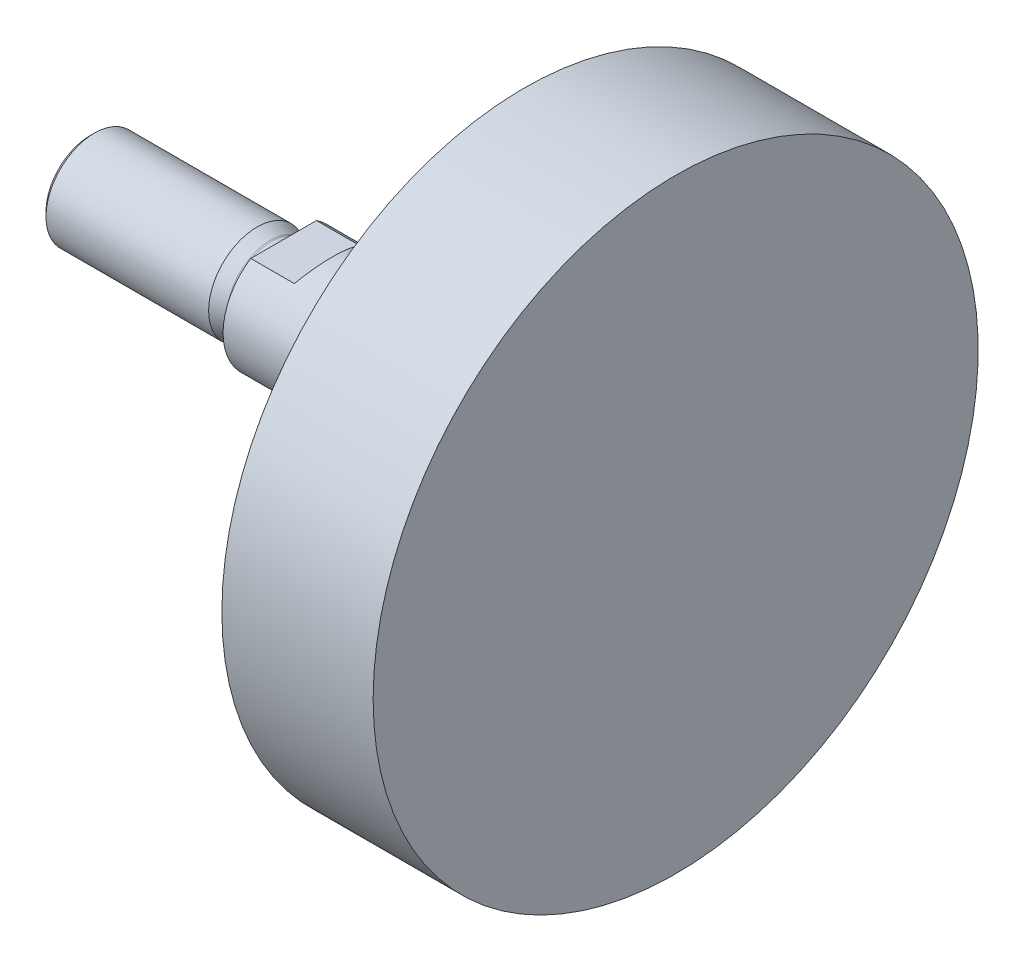
ISO-10303-21;
HEADER;
FILE_DESCRIPTION(('STEP AP214'),'2;1');
FILE_NAME('part.step','',(''),(''),'','','');
FILE_SCHEMA(('AUTOMOTIVE_DESIGN { 1 0 10303 214 1 1 1 1 }'));
ENDSEC;
DATA;
#1=APPLICATION_CONTEXT('core data for automotive mechanical design processes');
#2=APPLICATION_PROTOCOL_DEFINITION('international standard','automotive_design',2000,#1);
#3=PRODUCT_CONTEXT('',#1,'mechanical');
#4=PRODUCT('Part','Part','',(#3));
#5=PRODUCT_RELATED_PRODUCT_CATEGORY('part','',(#4));
#6=PRODUCT_DEFINITION_FORMATION('','',#4);
#7=PRODUCT_DEFINITION_CONTEXT('part definition',#1,'design');
#8=PRODUCT_DEFINITION('design','',#6,#7);
#9=PRODUCT_DEFINITION_SHAPE('','',#8);
#10=(LENGTH_UNIT() NAMED_UNIT(*) SI_UNIT(.MILLI.,.METRE.));
#11=(NAMED_UNIT(*) PLANE_ANGLE_UNIT() SI_UNIT($,.RADIAN.));
#12=(NAMED_UNIT(*) SI_UNIT($,.STERADIAN.) SOLID_ANGLE_UNIT());
#13=UNCERTAINTY_MEASURE_WITH_UNIT(LENGTH_MEASURE(1.E-05),#10,'distance_accuracy_value','');
#14=(GEOMETRIC_REPRESENTATION_CONTEXT(3) GLOBAL_UNCERTAINTY_ASSIGNED_CONTEXT((#13)) GLOBAL_UNIT_ASSIGNED_CONTEXT((#10,
#11,#12)) REPRESENTATION_CONTEXT('',''));
#15=CARTESIAN_POINT('',(0.,0.,0.));
#16=DIRECTION('',(0.,0.,1.));
#17=DIRECTION('',(1.,0.,0.));
#18=AXIS2_PLACEMENT_3D('',#15,#16,#17);
#19=CARTESIAN_POINT('',(70.,0.,0.));
#20=DIRECTION('',(-1.,0.,0.));
#21=DIRECTION('',(0.,0.,1.));
#22=AXIS2_PLACEMENT_3D('',#19,#20,#21);
#23=CYLINDRICAL_SURFACE('',#22,12.5);
#24=CARTESIAN_POINT('',(-8.06217782649105,0.,0.));
#25=DIRECTION('',(0.86602540378444,-0.499999999999998,0.));
#26=DIRECTION('',(-0.499999999999998,-0.86602540378444,0.));
#27=AXIS2_PLACEMENT_3D('',#24,#25,#26);
#28=ELLIPSE('',#27,14.4337567297406,12.5);
#29=CARTESIAN_POINT('',(-2.,10.5,-6.78232998312527));
#30=VERTEX_POINT('',#29);
#31=CARTESIAN_POINT('',(-2.,10.5,6.78232998312527));
#32=VERTEX_POINT('',#31);
#33=EDGE_CURVE('E11',#30,#32,#28,.T.);
#34=ORIENTED_EDGE('',*,*,#33,.T.);
#35=DIRECTION('',(-1.,0.,0.));
#36=VECTOR('',#35,1.);
#37=CARTESIAN_POINT('',(70.,10.5,6.78232998312527));
#38=LINE('',#37,#36);
#39=CARTESIAN_POINT('',(-11.,10.5,6.78232998312527));
#40=VERTEX_POINT('',#39);
#41=EDGE_CURVE('E181',#32,#40,#38,.T.);
#42=ORIENTED_EDGE('',*,*,#41,.T.);
#43=CARTESIAN_POINT('',(-11.,0.,0.));
#44=DIRECTION('',(-1.,0.,0.));
#45=DIRECTION('',(0.,0.,1.));
#46=AXIS2_PLACEMENT_3D('',#43,#44,#45);
#47=CIRCLE('',#46,12.5);
#48=CARTESIAN_POINT('',(-11.,-10.5,6.78232998312527));
#49=VERTEX_POINT('',#48);
#50=EDGE_CURVE('E103',#49,#40,#47,.T.);
#51=ORIENTED_EDGE('',*,*,#50,.F.);
#52=DIRECTION('',(-1.,0.,0.));
#53=VECTOR('',#52,1.);
#54=CARTESIAN_POINT('',(70.,-10.5,6.78232998312527));
#55=LINE('',#54,#53);
#56=CARTESIAN_POINT('',(-2.,-10.5,6.78232998312527));
#57=VERTEX_POINT('',#56);
#58=EDGE_CURVE('E58',#49,#57,#55,.F.);
#59=ORIENTED_EDGE('',*,*,#58,.T.);
#60=CARTESIAN_POINT('',(-8.0621778264911,0.,0.));
#61=DIRECTION('',(0.866025403784438,0.500000000000002,0.));
#62=DIRECTION('',(-0.500000000000002,0.866025403784438,0.));
#63=AXIS2_PLACEMENT_3D('',#60,#61,#62);
#64=ELLIPSE('',#63,14.4337567297407,12.5);
#65=CARTESIAN_POINT('',(-2.,-10.5,-6.78232998312527));
#66=VERTEX_POINT('',#65);
#67=EDGE_CURVE('E51',#57,#66,#64,.T.);
#68=ORIENTED_EDGE('',*,*,#67,.T.);
#69=DIRECTION('',(-1.,0.,0.));
#70=VECTOR('',#69,1.);
#71=CARTESIAN_POINT('',(70.,-10.5,-6.78232998312527));
#72=LINE('',#71,#70);
#73=CARTESIAN_POINT('',(-11.,-10.5,-6.78232998312527));
#74=VERTEX_POINT('',#73);
#75=EDGE_CURVE('E86',#66,#74,#72,.T.);
#76=ORIENTED_EDGE('',*,*,#75,.T.);
#77=CARTESIAN_POINT('',(-11.,10.5,-6.78232998312527));
#78=VERTEX_POINT('',#77);
#79=EDGE_CURVE('E99',#78,#74,#47,.T.);
#80=ORIENTED_EDGE('',*,*,#79,.F.);
#81=DIRECTION('',(-1.,0.,0.));
#82=VECTOR('',#81,1.);
#83=CARTESIAN_POINT('',(70.,10.5,-6.78232998312527));
#84=LINE('',#83,#82);
#85=EDGE_CURVE('E66',#78,#30,#84,.F.);
#86=ORIENTED_EDGE('',*,*,#85,.T.);
#87=EDGE_LOOP('',(#34,#42,#51,#59,#68,#76,#80,#86));
#88=FACE_BOUND('',#87,.T.);
#89=CARTESIAN_POINT('',(38.75,0.,0.));
#90=DIRECTION('',(1.,0.,0.));
#91=DIRECTION('',(0.,0.,-1.));
#92=AXIS2_PLACEMENT_3D('',#89,#90,#91);
#93=CIRCLE('',#92,12.5);
#94=CARTESIAN_POINT('',(38.75,0.,-12.5));
#95=VERTEX_POINT('',#94);
#96=EDGE_CURVE('E102',#95,#95,#93,.T.);
#97=ORIENTED_EDGE('',*,*,#96,.F.);
#98=EDGE_LOOP('',(#97));
#99=FACE_BOUND('',#98,.T.);
#100=ADVANCED_FACE('F43',(#88,#99),#23,.T.);
#101=CARTESIAN_POINT('',(-11.,0.,0.));
#102=DIRECTION('',(1.,0.,0.));
#103=DIRECTION('',(0.,0.,-1.));
#104=AXIS2_PLACEMENT_3D('',#101,#102,#103);
#105=PLANE('',#104);
#106=ORIENTED_EDGE('',*,*,#50,.T.);
#107=DIRECTION('',(0.,0.,-1.));
#108=VECTOR('',#107,1.);
#109=CARTESIAN_POINT('',(-11.,10.5,0.));
#110=LINE('',#109,#108);
#111=EDGE_CURVE('E92',#40,#78,#110,.T.);
#112=ORIENTED_EDGE('',*,*,#111,.T.);
#113=ORIENTED_EDGE('',*,*,#79,.T.);
#114=DIRECTION('',(0.,0.,1.));
#115=VECTOR('',#114,1.);
#116=CARTESIAN_POINT('',(-11.,-10.5,0.));
#117=LINE('',#116,#115);
#118=EDGE_CURVE('E83',#74,#49,#117,.T.);
#119=ORIENTED_EDGE('',*,*,#118,.T.);
#120=EDGE_LOOP('',(#106,#112,#113,#119));
#121=FACE_BOUND('',#120,.T.);
#122=CARTESIAN_POINT('',(-11.,0.,0.));
#123=DIRECTION('',(-1.,0.,0.));
#124=DIRECTION('',(0.,0.,1.));
#125=AXIS2_PLACEMENT_3D('',#122,#123,#124);
#126=CIRCLE('',#125,9.69999999999986);
#127=CARTESIAN_POINT('',(-11.,0.,9.69999999999986));
#128=VERTEX_POINT('',#127);
#129=EDGE_CURVE('E93',#128,#128,#126,.T.);
#130=ORIENTED_EDGE('',*,*,#129,.F.);
#131=EDGE_LOOP('',(#130));
#132=FACE_BOUND('',#131,.T.);
#133=ADVANCED_FACE('F45',(#121,#132),#105,.F.);
#134=CARTESIAN_POINT('',(38.75,0.,0.));
#135=DIRECTION('',(1.,0.,0.));
#136=DIRECTION('',(0.,0.,-1.));
#137=AXIS2_PLACEMENT_3D('',#134,#135,#136);
#138=PLANE('',#137);
#139=ORIENTED_EDGE('',*,*,#96,.T.);
#140=EDGE_LOOP('',(#139));
#141=FACE_BOUND('',#140,.T.);
#142=CARTESIAN_POINT('',(38.75,0.,0.));
#143=DIRECTION('',(-1.,0.,0.));
#144=DIRECTION('',(0.,0.,1.));
#145=AXIS2_PLACEMENT_3D('',#142,#143,#144);
#146=CIRCLE('',#145,62.5);
#147=CARTESIAN_POINT('',(38.75,0.,62.5));
#148=VERTEX_POINT('',#147);
#149=EDGE_CURVE('E107',#148,#148,#146,.T.);
#150=ORIENTED_EDGE('',*,*,#149,.T.);
#151=EDGE_LOOP('',(#150));
#152=FACE_BOUND('',#151,.T.);
#153=ADVANCED_FACE('F117',(#141,#152),#138,.F.);
#154=CARTESIAN_POINT('',(70.,0.,0.));
#155=DIRECTION('',(-1.,0.,0.));
#156=DIRECTION('',(0.,0.,1.));
#157=AXIS2_PLACEMENT_3D('',#154,#155,#156);
#158=CYLINDRICAL_SURFACE('',#157,62.5);
#159=ORIENTED_EDGE('',*,*,#149,.F.);
#160=EDGE_LOOP('',(#159));
#161=FACE_BOUND('',#160,.T.);
#162=CARTESIAN_POINT('',(70.,0.,0.));
#163=DIRECTION('',(-1.,0.,0.));
#164=DIRECTION('',(0.,0.,1.));
#165=AXIS2_PLACEMENT_3D('',#162,#163,#164);
#166=CIRCLE('',#165,62.5);
#167=CARTESIAN_POINT('',(70.,0.,62.5));
#168=VERTEX_POINT('',#167);
#169=EDGE_CURVE('E203',#168,#168,#166,.T.);
#170=ORIENTED_EDGE('',*,*,#169,.T.);
#171=EDGE_LOOP('',(#170));
#172=FACE_BOUND('',#171,.T.);
#173=ADVANCED_FACE('F122',(#161,#172),#158,.T.);
#174=CARTESIAN_POINT('',(70.,12.5,0.));
#175=DIRECTION('',(-1.,0.,0.));
#176=DIRECTION('',(0.,0.,1.));
#177=AXIS2_PLACEMENT_3D('',#174,#175,#176);
#178=PLANE('',#177);
#179=ORIENTED_EDGE('',*,*,#169,.F.);
#180=EDGE_LOOP('',(#179));
#181=FACE_BOUND('',#180,.T.);
#182=ADVANCED_FACE('F128',(#181),#178,.F.);
#183=CARTESIAN_POINT('',(-11.7499999999999,0.,0.));
#184=DIRECTION('',(-1.,0.,0.));
#185=DIRECTION('',(0.,0.,1.));
#186=AXIS2_PLACEMENT_3D('',#183,#184,#185);
#187=TOROIDAL_SURFACE('',#186,9.69999999999986,0.749999999999866);
#188=CARTESIAN_POINT('',(-11.75,0.,0.));
#189=DIRECTION('',(-1.,0.,0.));
#190=DIRECTION('',(0.,0.,1.));
#191=AXIS2_PLACEMENT_3D('',#188,#189,#190);
#192=CIRCLE('',#191,8.95);
#193=CARTESIAN_POINT('',(-11.75,0.,8.95));
#194=VERTEX_POINT('',#193);
#195=EDGE_CURVE('E201',#194,#194,#192,.T.);
#196=ORIENTED_EDGE('',*,*,#195,.F.);
#197=EDGE_LOOP('',(#196));
#198=FACE_BOUND('',#197,.T.);
#199=ORIENTED_EDGE('',*,*,#129,.T.);
#200=EDGE_LOOP('',(#199));
#201=FACE_BOUND('',#200,.T.);
#202=ADVANCED_FACE('F115',(#198,#201),#187,.F.);
#203=CARTESIAN_POINT('',(-10.,0.,0.));
#204=DIRECTION('',(-1.,0.,0.));
#205=DIRECTION('',(0.,0.,1.));
#206=AXIS2_PLACEMENT_3D('',#203,#204,#205);
#207=CYLINDRICAL_SURFACE('',#206,8.95);
#208=CARTESIAN_POINT('',(-13.467754764469,0.,0.));
#209=DIRECTION('',(-1.,0.,0.));
#210=DIRECTION('',(0.,0.,1.));
#211=AXIS2_PLACEMENT_3D('',#208,#209,#210);
#212=CIRCLE('',#211,8.95);
#213=CARTESIAN_POINT('',(-13.467754764469,0.,8.95));
#214=VERTEX_POINT('',#213);
#215=EDGE_CURVE('E198',#214,#214,#212,.T.);
#216=ORIENTED_EDGE('',*,*,#215,.F.);
#217=EDGE_LOOP('',(#216));
#218=FACE_BOUND('',#217,.T.);
#219=ORIENTED_EDGE('',*,*,#195,.T.);
#220=EDGE_LOOP('',(#219));
#221=FACE_BOUND('',#220,.T.);
#222=ADVANCED_FACE('F137',(#218,#221),#207,.T.);
#223=CARTESIAN_POINT('',(-13.4677547644694,0.,0.));
#224=DIRECTION('',(-1.,0.,0.));
#225=DIRECTION('',(0.,0.,1.));
#226=AXIS2_PLACEMENT_3D('',#223,#224,#225);
#227=TOROIDAL_SURFACE('',#226,9.69999999999569,0.749999999995687);
#228=CARTESIAN_POINT('',(-13.7242698719622,0.,0.));
#229=DIRECTION('',(-1.,0.,0.));
#230=DIRECTION('',(0.,0.,1.));
#231=AXIS2_PLACEMENT_3D('',#228,#229,#230);
#232=CIRCLE('',#231,8.99523053441032);
#233=CARTESIAN_POINT('',(-13.7242698719622,0.,8.99523053441032));
#234=VERTEX_POINT('',#233);
#235=EDGE_CURVE('E195',#234,#234,#232,.T.);
#236=ORIENTED_EDGE('',*,*,#235,.F.);
#237=EDGE_LOOP('',(#236));
#238=FACE_BOUND('',#237,.T.);
#239=ORIENTED_EDGE('',*,*,#215,.T.);
#240=EDGE_LOOP('',(#239));
#241=FACE_BOUND('',#240,.T.);
#242=ADVANCED_FACE('F141',(#238,#241),#227,.F.);
#243=CARTESIAN_POINT('',(-13.7242698719622,0.,0.));
#244=DIRECTION('',(-1.,0.,0.));
#245=DIRECTION('',(0.,0.,1.));
#246=AXIS2_PLACEMENT_3D('',#243,#244,#245);
#247=CONICAL_SURFACE('',#246,8.99523053441032,0.349065850398908);
#248=CARTESIAN_POINT('',(-16.484851290427,0.,0.));
#249=DIRECTION('',(-1.,0.,0.));
#250=DIRECTION('',(0.,0.,1.));
#251=AXIS2_PLACEMENT_3D('',#248,#249,#250);
#252=CIRCLE('',#251,10.);
#253=CARTESIAN_POINT('',(-16.484851290427,0.,10.));
#254=VERTEX_POINT('',#253);
#255=EDGE_CURVE('E192',#254,#254,#252,.T.);
#256=ORIENTED_EDGE('',*,*,#255,.F.);
#257=EDGE_LOOP('',(#256));
#258=FACE_BOUND('',#257,.T.);
#259=ORIENTED_EDGE('',*,*,#235,.T.);
#260=EDGE_LOOP('',(#259));
#261=FACE_BOUND('',#260,.T.);
#262=ADVANCED_FACE('F145',(#258,#261),#247,.T.);
#263=CARTESIAN_POINT('',(-10.,0.,0.));
#264=DIRECTION('',(-1.,0.,0.));
#265=DIRECTION('',(0.,0.,1.));
#266=AXIS2_PLACEMENT_3D('',#263,#264,#265);
#267=CYLINDRICAL_SURFACE('',#266,10.);
#268=CARTESIAN_POINT('',(-50.08,0.,0.));
#269=DIRECTION('',(-1.,0.,0.));
#270=DIRECTION('',(0.,0.,1.));
#271=AXIS2_PLACEMENT_3D('',#268,#269,#270);
#272=CIRCLE('',#271,10.);
#273=CARTESIAN_POINT('',(-50.08,0.,10.));
#274=VERTEX_POINT('',#273);
#275=EDGE_CURVE('E189',#274,#274,#272,.T.);
#276=ORIENTED_EDGE('',*,*,#275,.F.);
#277=EDGE_LOOP('',(#276));
#278=FACE_BOUND('',#277,.T.);
#279=ORIENTED_EDGE('',*,*,#255,.T.);
#280=EDGE_LOOP('',(#279));
#281=FACE_BOUND('',#280,.T.);
#282=ADVANCED_FACE('F149',(#278,#281),#267,.T.);
#283=CARTESIAN_POINT('',(-50.08,0.,0.));
#284=DIRECTION('',(1.,0.,0.));
#285=DIRECTION('',(0.,0.,-1.));
#286=AXIS2_PLACEMENT_3D('',#283,#284,#285);
#287=CONICAL_SURFACE('',#286,10.,0.785398163397446);
#288=CARTESIAN_POINT('',(-51.,0.,0.));
#289=DIRECTION('',(-1.,0.,0.));
#290=DIRECTION('',(0.,0.,1.));
#291=AXIS2_PLACEMENT_3D('',#288,#289,#290);
#292=CIRCLE('',#291,9.08);
#293=CARTESIAN_POINT('',(-51.,0.,9.08));
#294=VERTEX_POINT('',#293);
#295=EDGE_CURVE('E183',#294,#294,#292,.T.);
#296=ORIENTED_EDGE('',*,*,#295,.F.);
#297=EDGE_LOOP('',(#296));
#298=FACE_BOUND('',#297,.T.);
#299=ORIENTED_EDGE('',*,*,#275,.T.);
#300=EDGE_LOOP('',(#299));
#301=FACE_BOUND('',#300,.T.);
#302=ADVANCED_FACE('F153',(#298,#301),#287,.T.);
#303=CARTESIAN_POINT('',(-51.,0.,0.));
#304=DIRECTION('',(1.,0.,0.));
#305=DIRECTION('',(0.,0.,-1.));
#306=AXIS2_PLACEMENT_3D('',#303,#304,#305);
#307=PLANE('',#306);
#308=ORIENTED_EDGE('',*,*,#295,.T.);
#309=EDGE_LOOP('',(#308));
#310=FACE_BOUND('',#309,.T.);
#311=ADVANCED_FACE('F157',(#310),#307,.F.);
#312=CARTESIAN_POINT('',(-2.,-10.5,-25.));
#313=DIRECTION('',(0.,1.,0.));
#314=DIRECTION('',(0.,0.,1.));
#315=AXIS2_PLACEMENT_3D('',#312,#313,#314);
#316=PLANE('',#315);
#317=DIRECTION('',(0.,0.,1.));
#318=VECTOR('',#317,1.);
#319=CARTESIAN_POINT('',(-2.,-10.5,-25.));
#320=LINE('',#319,#318);
#321=EDGE_CURVE('E178',#66,#57,#320,.T.);
#322=ORIENTED_EDGE('',*,*,#321,.T.);
#323=ORIENTED_EDGE('',*,*,#58,.F.);
#324=ORIENTED_EDGE('',*,*,#118,.F.);
#325=ORIENTED_EDGE('',*,*,#75,.F.);
#326=EDGE_LOOP('',(#322,#323,#324,#325));
#327=FACE_BOUND('',#326,.T.);
#328=ADVANCED_FACE('F85',(#327),#316,.F.);
#329=CARTESIAN_POINT('',(8.1036297108185,-28.,-25.));
#330=DIRECTION('',(0.866025403784438,0.500000000000002,0.));
#331=DIRECTION('',(-0.500000000000002,0.866025403784438,0.));
#332=AXIS2_PLACEMENT_3D('',#329,#330,#331);
#333=PLANE('',#332);
#334=ORIENTED_EDGE('',*,*,#321,.F.);
#335=ORIENTED_EDGE('',*,*,#67,.F.);
#336=EDGE_LOOP('',(#334,#335));
#337=FACE_BOUND('',#336,.T.);
#338=ADVANCED_FACE('F162',(#337),#333,.F.);
#339=CARTESIAN_POINT('',(-2.,10.5,-25.));
#340=DIRECTION('',(0.86602540378444,-0.499999999999998,0.));
#341=DIRECTION('',(0.499999999999998,0.86602540378444,0.));
#342=AXIS2_PLACEMENT_3D('',#339,#340,#341);
#343=PLANE('',#342);
#344=DIRECTION('',(0.,0.,1.));
#345=VECTOR('',#344,1.);
#346=CARTESIAN_POINT('',(-2.,10.5,-25.));
#347=LINE('',#346,#345);
#348=EDGE_CURVE('E177',#30,#32,#347,.T.);
#349=ORIENTED_EDGE('',*,*,#348,.T.);
#350=ORIENTED_EDGE('',*,*,#33,.F.);
#351=EDGE_LOOP('',(#349,#350));
#352=FACE_BOUND('',#351,.T.);
#353=ADVANCED_FACE('F165',(#352),#343,.F.);
#354=CARTESIAN_POINT('',(-11.,10.5,-25.));
#355=DIRECTION('',(0.,-1.,0.));
#356=DIRECTION('',(0.,0.,-1.));
#357=AXIS2_PLACEMENT_3D('',#354,#355,#356);
#358=PLANE('',#357);
#359=ORIENTED_EDGE('',*,*,#348,.F.);
#360=ORIENTED_EDGE('',*,*,#85,.F.);
#361=ORIENTED_EDGE('',*,*,#111,.F.);
#362=ORIENTED_EDGE('',*,*,#41,.F.);
#363=EDGE_LOOP('',(#359,#360,#361,#362));
#364=FACE_BOUND('',#363,.T.);
#365=ADVANCED_FACE('F169',(#364),#358,.F.);
#366=CLOSED_SHELL('',(#100,#133,#153,#173,#182,#202,#222,#242,#262,#282,#302,#311,#328,#338,
#353,#365));
#367=MANIFOLD_SOLID_BREP('B2',#366);
#368=ADVANCED_BREP_SHAPE_REPRESENTATION('',(#18,#367),#14);
#369=SHAPE_DEFINITION_REPRESENTATION(#9,#368);
ENDSEC;
END-ISO-10303-21;
